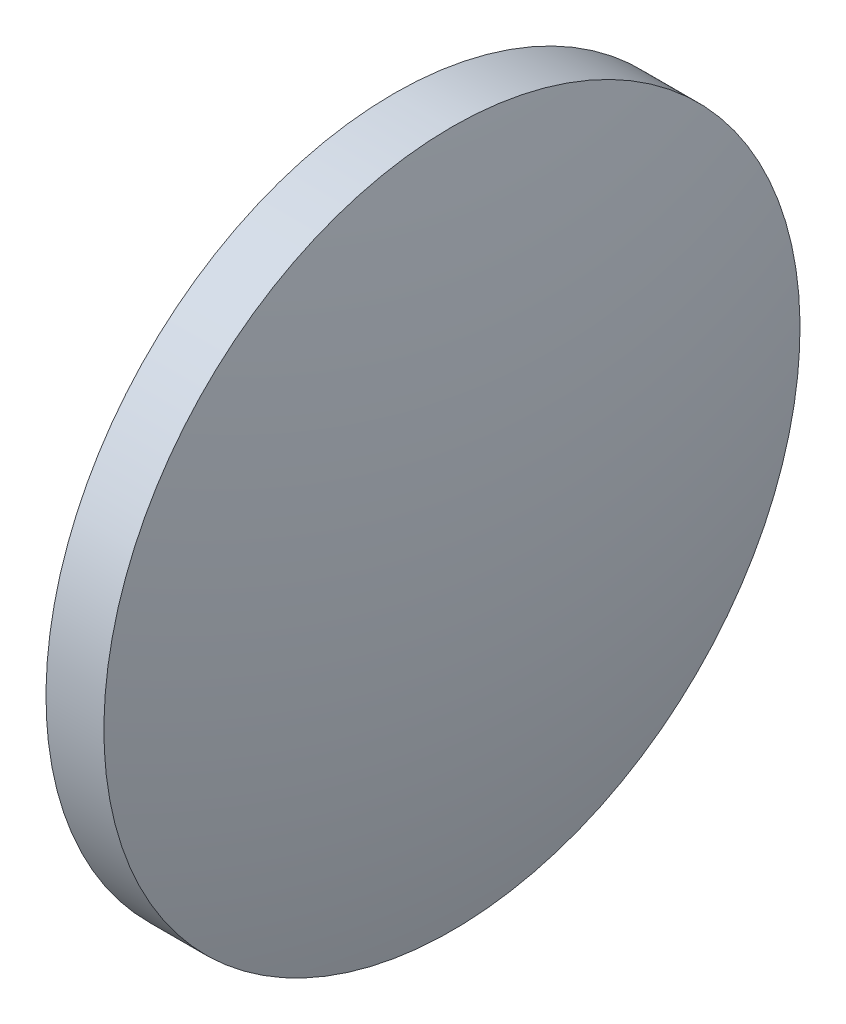
ISO-10303-21;
HEADER;
FILE_DESCRIPTION(('STEP AP214'),'2;1');
FILE_NAME('part.step','',(''),(''),'','','');
FILE_SCHEMA(('AUTOMOTIVE_DESIGN { 1 0 10303 214 1 1 1 1 }'));
ENDSEC;
DATA;
#1=APPLICATION_CONTEXT('core data for automotive mechanical design processes');
#2=APPLICATION_PROTOCOL_DEFINITION('international standard','automotive_design',2000,#1);
#3=PRODUCT_CONTEXT('',#1,'mechanical');
#4=PRODUCT('Part','Part','',(#3));
#5=PRODUCT_RELATED_PRODUCT_CATEGORY('part','',(#4));
#6=PRODUCT_DEFINITION_FORMATION('','',#4);
#7=PRODUCT_DEFINITION_CONTEXT('part definition',#1,'design');
#8=PRODUCT_DEFINITION('design','',#6,#7);
#9=PRODUCT_DEFINITION_SHAPE('','',#8);
#10=(LENGTH_UNIT() NAMED_UNIT(*) SI_UNIT(.MILLI.,.METRE.));
#11=(NAMED_UNIT(*) PLANE_ANGLE_UNIT() SI_UNIT($,.RADIAN.));
#12=(NAMED_UNIT(*) SI_UNIT($,.STERADIAN.) SOLID_ANGLE_UNIT());
#13=UNCERTAINTY_MEASURE_WITH_UNIT(LENGTH_MEASURE(1.E-05),#10,'distance_accuracy_value','');
#14=(GEOMETRIC_REPRESENTATION_CONTEXT(3) GLOBAL_UNCERTAINTY_ASSIGNED_CONTEXT((#13)) GLOBAL_UNIT_ASSIGNED_CONTEXT((#10,
#11,#12)) REPRESENTATION_CONTEXT('',''));
#15=CARTESIAN_POINT('',(0.,0.,0.));
#16=DIRECTION('',(0.,0.,1.));
#17=DIRECTION('',(1.,0.,0.));
#18=AXIS2_PLACEMENT_3D('',#15,#16,#17);
#19=CARTESIAN_POINT('',(18.4182596054392,23.9252524720398,0.));
#20=DIRECTION('',(1.,0.,0.));
#21=DIRECTION('',(0.,1.,0.));
#22=AXIS2_PLACEMENT_3D('',#19,#20,#21);
#23=SPHERICAL_SURFACE('',#22,25.4300641025641);
#24=CARTESIAN_POINT('',(43.0683237080032,23.9252524720398,0.));
#25=DIRECTION('',(1.,0.,0.));
#26=DIRECTION('',(0.,1.,0.));
#27=AXIS2_PLACEMENT_3D('',#24,#25,#26);
#28=CIRCLE('',#27,6.25);
#29=CARTESIAN_POINT('',(43.0683237080032,30.1752524720398,0.));
#30=VERTEX_POINT('',#29);
#31=EDGE_CURVE('E10',#30,#30,#28,.T.);
#32=ORIENTED_EDGE('',*,*,#31,.T.);
#33=EDGE_LOOP('',(#32));
#34=FACE_BOUND('',#33,.T.);
#35=ADVANCED_FACE('F35',(#34),#23,.T.);
#36=CARTESIAN_POINT('',(45.1430220399201,23.9252524720398,0.));
#37=DIRECTION('',(1.,0.,0.));
#38=DIRECTION('',(0.,1.,0.));
#39=AXIS2_PLACEMENT_3D('',#36,#37,#38);
#40=CYLINDRICAL_SURFACE('',#39,6.25);
#41=ORIENTED_EDGE('',*,*,#31,.F.);
#42=EDGE_LOOP('',(#41));
#43=FACE_BOUND('',#42,.T.);
#44=CARTESIAN_POINT('',(42.0283237080032,23.9252524720398,0.));
#45=DIRECTION('',(1.,0.,0.));
#46=DIRECTION('',(0.,1.,0.));
#47=AXIS2_PLACEMENT_3D('',#44,#45,#46);
#48=CIRCLE('',#47,6.25);
#49=CARTESIAN_POINT('',(42.0283237080032,30.1752524720398,0.));
#50=VERTEX_POINT('',#49);
#51=EDGE_CURVE('E41',#50,#50,#48,.T.);
#52=ORIENTED_EDGE('',*,*,#51,.T.);
#53=EDGE_LOOP('',(#52));
#54=FACE_BOUND('',#53,.T.);
#55=ADVANCED_FACE('F47',(#43,#54),#40,.T.);
#56=CARTESIAN_POINT('',(66.6783878105675,23.9252524720398,0.));
#57=DIRECTION('',(1.,0.,0.));
#58=DIRECTION('',(0.,1.,0.));
#59=AXIS2_PLACEMENT_3D('',#56,#57,#58);
#60=SPHERICAL_SURFACE('',#59,25.4300641025642);
#61=ORIENTED_EDGE('',*,*,#51,.F.);
#62=EDGE_LOOP('',(#61));
#63=FACE_BOUND('',#62,.T.);
#64=ADVANCED_FACE('F49',(#63),#60,.T.);
#65=CLOSED_SHELL('',(#35,#55,#64));
#66=MANIFOLD_SOLID_BREP('B2',#65);
#67=ADVANCED_BREP_SHAPE_REPRESENTATION('',(#18,#66),#14);
#68=SHAPE_DEFINITION_REPRESENTATION(#9,#67);
ENDSEC;
END-ISO-10303-21;
